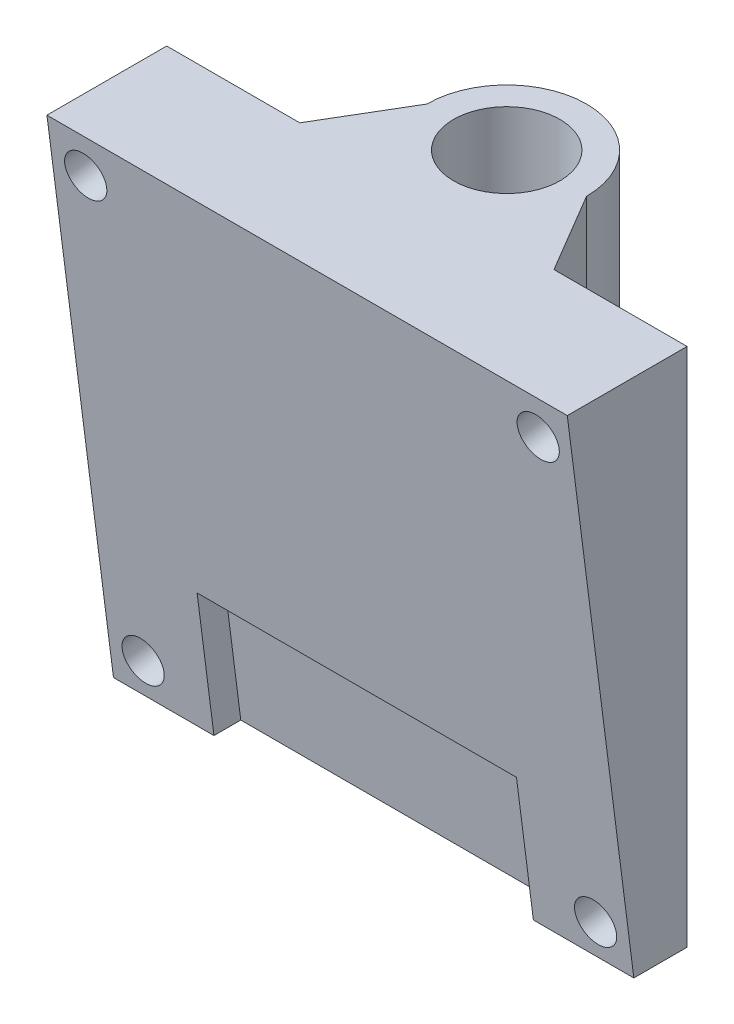
ISO-10303-21;
HEADER;
FILE_DESCRIPTION(('STEP AP214'),'2;1');
FILE_NAME('part.step','',(''),(''),'','','');
FILE_SCHEMA(('AUTOMOTIVE_DESIGN { 1 0 10303 214 1 1 1 1 }'));
ENDSEC;
DATA;
#1=APPLICATION_CONTEXT('core data for automotive mechanical design processes');
#2=APPLICATION_PROTOCOL_DEFINITION('international standard','automotive_design',2000,#1);
#3=PRODUCT_CONTEXT('',#1,'mechanical');
#4=PRODUCT('Part','Part','',(#3));
#5=PRODUCT_RELATED_PRODUCT_CATEGORY('part','',(#4));
#6=PRODUCT_DEFINITION_FORMATION('','',#4);
#7=PRODUCT_DEFINITION_CONTEXT('part definition',#1,'design');
#8=PRODUCT_DEFINITION('design','',#6,#7);
#9=PRODUCT_DEFINITION_SHAPE('','',#8);
#10=(LENGTH_UNIT() NAMED_UNIT(*) SI_UNIT(.MILLI.,.METRE.));
#11=(NAMED_UNIT(*) PLANE_ANGLE_UNIT() SI_UNIT($,.RADIAN.));
#12=(NAMED_UNIT(*) SI_UNIT($,.STERADIAN.) SOLID_ANGLE_UNIT());
#13=UNCERTAINTY_MEASURE_WITH_UNIT(LENGTH_MEASURE(1.E-05),#10,'distance_accuracy_value','');
#14=(GEOMETRIC_REPRESENTATION_CONTEXT(3) GLOBAL_UNCERTAINTY_ASSIGNED_CONTEXT((#13)) GLOBAL_UNIT_ASSIGNED_CONTEXT((#10,
#11,#12)) REPRESENTATION_CONTEXT('',''));
#15=CARTESIAN_POINT('',(0.,0.,0.));
#16=DIRECTION('',(0.,0.,1.));
#17=DIRECTION('',(1.,0.,0.));
#18=AXIS2_PLACEMENT_3D('',#15,#16,#17);
#19=CARTESIAN_POINT('',(0.,39.1,0.));
#20=DIRECTION('',(0.,1.,0.));
#21=DIRECTION('',(0.,0.,1.));
#22=AXIS2_PLACEMENT_3D('',#19,#20,#21);
#23=PLANE('',#22);
#24=DIRECTION('',(0.,0.,1.));
#25=VECTOR('',#24,1.);
#26=CARTESIAN_POINT('',(-19.55,39.1,10.));
#27=LINE('',#26,#25);
#28=CARTESIAN_POINT('',(-19.55,39.1,6.));
#29=VERTEX_POINT('',#28);
#30=CARTESIAN_POINT('',(-19.55,39.1,15.));
#31=VERTEX_POINT('',#30);
#32=EDGE_CURVE('E154',#29,#31,#27,.T.);
#33=ORIENTED_EDGE('',*,*,#32,.T.);
#34=DIRECTION('',(1.,0.,0.));
#35=VECTOR('',#34,1.);
#36=CARTESIAN_POINT('',(-19.55,39.1,15.));
#37=LINE('',#36,#35);
#38=CARTESIAN_POINT('',(19.55,39.1,15.));
#39=VERTEX_POINT('',#38);
#40=EDGE_CURVE('E230',#31,#39,#37,.T.);
#41=ORIENTED_EDGE('',*,*,#40,.T.);
#42=DIRECTION('',(0.,0.,-1.));
#43=VECTOR('',#42,1.);
#44=CARTESIAN_POINT('',(19.55,39.1,9.99999999999999));
#45=LINE('',#44,#43);
#46=CARTESIAN_POINT('',(19.55,39.1,5.99999999999999));
#47=VERTEX_POINT('',#46);
#48=EDGE_CURVE('E97',#39,#47,#45,.T.);
#49=ORIENTED_EDGE('',*,*,#48,.T.);
#50=DIRECTION('',(-1.,0.,0.));
#51=VECTOR('',#50,1.);
#52=CARTESIAN_POINT('',(19.55,39.1,5.99999999999999));
#53=LINE('',#52,#51);
#54=CARTESIAN_POINT('',(9.55,39.1,6.));
#55=VERTEX_POINT('',#54);
#56=EDGE_CURVE('E241',#47,#55,#53,.T.);
#57=ORIENTED_EDGE('',*,*,#56,.T.);
#58=DIRECTION('',(-0.509212491251785,0.,-0.860640830284707));
#59=VECTOR('',#58,1.);
#60=CARTESIAN_POINT('',(9.55,39.1,6.));
#61=LINE('',#60,#59);
#62=CARTESIAN_POINT('',(6.,39.1,0.));
#63=VERTEX_POINT('',#62);
#64=EDGE_CURVE('E115',#55,#63,#61,.T.);
#65=ORIENTED_EDGE('',*,*,#64,.T.);
#66=CARTESIAN_POINT('',(0.,39.1,0.));
#67=DIRECTION('',(0.,1.,0.));
#68=DIRECTION('',(0.,0.,1.));
#69=AXIS2_PLACEMENT_3D('',#66,#67,#68);
#70=CIRCLE('',#69,6.);
#71=CARTESIAN_POINT('',(-6.,39.1,0.));
#72=VERTEX_POINT('',#71);
#73=EDGE_CURVE('E108',#63,#72,#70,.T.);
#74=ORIENTED_EDGE('',*,*,#73,.T.);
#75=DIRECTION('',(-0.509212491251785,0.,0.860640830284707));
#76=VECTOR('',#75,1.);
#77=CARTESIAN_POINT('',(-9.55,39.1,6.));
#78=LINE('',#77,#76);
#79=CARTESIAN_POINT('',(-9.55,39.1,6.));
#80=VERTEX_POINT('',#79);
#81=EDGE_CURVE('E112',#72,#80,#78,.T.);
#82=ORIENTED_EDGE('',*,*,#81,.T.);
#83=DIRECTION('',(-1.,0.,0.));
#84=VECTOR('',#83,1.);
#85=CARTESIAN_POINT('',(-19.55,39.1,6.));
#86=LINE('',#85,#84);
#87=EDGE_CURVE('E59',#80,#29,#86,.T.);
#88=ORIENTED_EDGE('',*,*,#87,.T.);
#89=EDGE_LOOP('',(#33,#41,#49,#57,#65,#74,#82,#88));
#90=FACE_BOUND('',#89,.T.);
#91=CARTESIAN_POINT('',(0.,39.1,0.));
#92=DIRECTION('',(0.,1.,0.));
#93=DIRECTION('',(0.,0.,1.));
#94=AXIS2_PLACEMENT_3D('',#91,#92,#93);
#95=CIRCLE('',#94,4.);
#96=CARTESIAN_POINT('',(0.,39.1,4.));
#97=VERTEX_POINT('',#96);
#98=EDGE_CURVE('E140',#97,#97,#95,.T.);
#99=ORIENTED_EDGE('',*,*,#98,.F.);
#100=EDGE_LOOP('',(#99));
#101=FACE_BOUND('',#100,.T.);
#102=ADVANCED_FACE('F35',(#90,#101),#23,.T.);
#103=CARTESIAN_POINT('',(0.,0.,0.));
#104=DIRECTION('',(0.,1.,0.));
#105=DIRECTION('',(0.,0.,1.));
#106=AXIS2_PLACEMENT_3D('',#103,#104,#105);
#107=PLANE('',#106);
#108=DIRECTION('',(-1.,0.,0.));
#109=VECTOR('',#108,1.);
#110=CARTESIAN_POINT('',(0.,0.,7.98371372274613));
#111=LINE('',#110,#109);
#112=CARTESIAN_POINT('',(12.,0.,7.98371372274613));
#113=VERTEX_POINT('',#112);
#114=CARTESIAN_POINT('',(-12.,0.,7.98371372274613));
#115=VERTEX_POINT('',#114);
#116=EDGE_CURVE('E11',#113,#115,#111,.T.);
#117=ORIENTED_EDGE('',*,*,#116,.T.);
#118=DIRECTION('',(0.,0.,1.));
#119=VECTOR('',#118,1.);
#120=CARTESIAN_POINT('',(-12.,0.,0.));
#121=LINE('',#120,#119);
#122=CARTESIAN_POINT('',(-12.,0.,10.));
#123=VERTEX_POINT('',#122);
#124=EDGE_CURVE('E209',#115,#123,#121,.T.);
#125=ORIENTED_EDGE('',*,*,#124,.T.);
#126=DIRECTION('',(1.,0.,0.));
#127=VECTOR('',#126,1.);
#128=CARTESIAN_POINT('',(-19.55,0.,10.));
#129=LINE('',#128,#127);
#130=CARTESIAN_POINT('',(-19.55,0.,9.99999999999999));
#131=VERTEX_POINT('',#130);
#132=EDGE_CURVE('E141',#131,#123,#129,.T.);
#133=ORIENTED_EDGE('',*,*,#132,.F.);
#134=DIRECTION('',(0.,0.,1.));
#135=VECTOR('',#134,1.);
#136=CARTESIAN_POINT('',(-19.55,0.,10.));
#137=LINE('',#136,#135);
#138=CARTESIAN_POINT('',(-19.55,0.,6.));
#139=VERTEX_POINT('',#138);
#140=EDGE_CURVE('E136',#139,#131,#137,.T.);
#141=ORIENTED_EDGE('',*,*,#140,.F.);
#142=DIRECTION('',(-1.,0.,0.));
#143=VECTOR('',#142,1.);
#144=CARTESIAN_POINT('',(-19.55,0.,6.));
#145=LINE('',#144,#143);
#146=CARTESIAN_POINT('',(-9.55,0.,6.));
#147=VERTEX_POINT('',#146);
#148=EDGE_CURVE('E89',#147,#139,#145,.T.);
#149=ORIENTED_EDGE('',*,*,#148,.F.);
#150=DIRECTION('',(-0.509212491251785,0.,0.860640830284707));
#151=VECTOR('',#150,1.);
#152=CARTESIAN_POINT('',(-9.55,0.,6.));
#153=LINE('',#152,#151);
#154=CARTESIAN_POINT('',(-6.,0.,0.));
#155=VERTEX_POINT('',#154);
#156=EDGE_CURVE('E151',#155,#147,#153,.T.);
#157=ORIENTED_EDGE('',*,*,#156,.F.);
#158=CARTESIAN_POINT('',(0.,0.,0.));
#159=DIRECTION('',(0.,1.,0.));
#160=DIRECTION('',(0.,0.,1.));
#161=AXIS2_PLACEMENT_3D('',#158,#159,#160);
#162=CIRCLE('',#161,6.);
#163=CARTESIAN_POINT('',(6.,0.,0.));
#164=VERTEX_POINT('',#163);
#165=EDGE_CURVE('E124',#164,#155,#162,.T.);
#166=ORIENTED_EDGE('',*,*,#165,.F.);
#167=DIRECTION('',(-0.509212491251785,0.,-0.860640830284707));
#168=VECTOR('',#167,1.);
#169=CARTESIAN_POINT('',(9.55,0.,6.));
#170=LINE('',#169,#168);
#171=CARTESIAN_POINT('',(9.55,0.,6.));
#172=VERTEX_POINT('',#171);
#173=EDGE_CURVE('E148',#172,#164,#170,.T.);
#174=ORIENTED_EDGE('',*,*,#173,.F.);
#175=DIRECTION('',(-1.,0.,0.));
#176=VECTOR('',#175,1.);
#177=CARTESIAN_POINT('',(19.55,0.,5.99999999999999));
#178=LINE('',#177,#176);
#179=CARTESIAN_POINT('',(19.55,0.,5.99999999999999));
#180=VERTEX_POINT('',#179);
#181=EDGE_CURVE('E146',#180,#172,#178,.T.);
#182=ORIENTED_EDGE('',*,*,#181,.F.);
#183=DIRECTION('',(0.,0.,-1.));
#184=VECTOR('',#183,1.);
#185=CARTESIAN_POINT('',(19.55,0.,9.99999999999999));
#186=LINE('',#185,#184);
#187=CARTESIAN_POINT('',(19.55,0.,9.99999999999999));
#188=VERTEX_POINT('',#187);
#189=EDGE_CURVE('E144',#188,#180,#186,.T.);
#190=ORIENTED_EDGE('',*,*,#189,.F.);
#191=CARTESIAN_POINT('',(12.,0.,10.));
#192=VERTEX_POINT('',#191);
#193=EDGE_CURVE('E139',#192,#188,#129,.T.);
#194=ORIENTED_EDGE('',*,*,#193,.F.);
#195=DIRECTION('',(0.,0.,-1.));
#196=VECTOR('',#195,1.);
#197=CARTESIAN_POINT('',(12.,0.,0.));
#198=LINE('',#197,#196);
#199=EDGE_CURVE('E50',#192,#113,#198,.T.);
#200=ORIENTED_EDGE('',*,*,#199,.T.);
#201=EDGE_LOOP('',(#117,#125,#133,#141,#149,#157,#166,#174,#182,#190,#194,#200));
#202=FACE_BOUND('',#201,.T.);
#203=CARTESIAN_POINT('',(0.,0.,0.));
#204=DIRECTION('',(0.,1.,0.));
#205=DIRECTION('',(0.,0.,1.));
#206=AXIS2_PLACEMENT_3D('',#203,#204,#205);
#207=CIRCLE('',#206,4.);
#208=CARTESIAN_POINT('',(0.,0.,4.));
#209=VERTEX_POINT('',#208);
#210=EDGE_CURVE('E234',#209,#209,#207,.T.);
#211=ORIENTED_EDGE('',*,*,#210,.T.);
#212=EDGE_LOOP('',(#211));
#213=FACE_BOUND('',#212,.T.);
#214=ADVANCED_FACE('F251',(#202,#213),#107,.F.);
#215=CARTESIAN_POINT('',(-19.55,39.1,10.));
#216=DIRECTION('',(1.,0.,0.));
#217=DIRECTION('',(0.,0.,-1.));
#218=AXIS2_PLACEMENT_3D('',#215,#216,#217);
#219=PLANE('',#218);
#220=ORIENTED_EDGE('',*,*,#140,.T.);
#221=DIRECTION('',(0.,-0.991922636464077,-0.126844326913565));
#222=VECTOR('',#221,1.);
#223=CARTESIAN_POINT('',(-19.55,0.,9.99999999999999));
#224=LINE('',#223,#222);
#225=EDGE_CURVE('E227',#31,#131,#224,.T.);
#226=ORIENTED_EDGE('',*,*,#225,.F.);
#227=ORIENTED_EDGE('',*,*,#32,.F.);
#228=DIRECTION('',(0.,-1.,0.));
#229=VECTOR('',#228,1.);
#230=CARTESIAN_POINT('',(-19.55,39.1,6.));
#231=LINE('',#230,#229);
#232=EDGE_CURVE('E132',#29,#139,#231,.T.);
#233=ORIENTED_EDGE('',*,*,#232,.T.);
#234=EDGE_LOOP('',(#220,#226,#227,#233));
#235=FACE_BOUND('',#234,.T.);
#236=ADVANCED_FACE('F37',(#235),#219,.F.);
#237=CARTESIAN_POINT('',(19.55,39.1,9.99999999999999));
#238=DIRECTION('',(-1.,0.,0.));
#239=DIRECTION('',(0.,0.,1.));
#240=AXIS2_PLACEMENT_3D('',#237,#238,#239);
#241=PLANE('',#240);
#242=ORIENTED_EDGE('',*,*,#189,.T.);
#243=DIRECTION('',(0.,-1.,0.));
#244=VECTOR('',#243,1.);
#245=CARTESIAN_POINT('',(19.55,39.1,5.99999999999999));
#246=LINE('',#245,#244);
#247=EDGE_CURVE('E161',#47,#180,#246,.T.);
#248=ORIENTED_EDGE('',*,*,#247,.F.);
#249=ORIENTED_EDGE('',*,*,#48,.F.);
#250=DIRECTION('',(0.,-0.991922636464077,-0.126844326913565));
#251=VECTOR('',#250,1.);
#252=CARTESIAN_POINT('',(19.55,0.,9.99999999999999));
#253=LINE('',#252,#251);
#254=EDGE_CURVE('E226',#39,#188,#253,.T.);
#255=ORIENTED_EDGE('',*,*,#254,.T.);
#256=EDGE_LOOP('',(#242,#248,#249,#255));
#257=FACE_BOUND('',#256,.T.);
#258=ADVANCED_FACE('F265',(#257),#241,.F.);
#259=CARTESIAN_POINT('',(19.55,39.1,5.99999999999999));
#260=DIRECTION('',(0.,0.,1.));
#261=DIRECTION('',(1.,0.,0.));
#262=AXIS2_PLACEMENT_3D('',#259,#260,#261);
#263=PLANE('',#262);
#264=CARTESIAN_POINT('',(17.,37.3591406682212,5.99999999999999));
#265=DIRECTION('',(0.,0.,1.));
#266=DIRECTION('',(0.,-1.,0.));
#267=AXIS2_PLACEMENT_3D('',#264,#265,#266);
#268=ELLIPSE('',#267,1.58782544333742,1.57499999999999);
#269=CARTESIAN_POINT('',(17.,35.7713152248838,5.99999999999999));
#270=VERTEX_POINT('',#269);
#271=EDGE_CURVE('E169',#270,#270,#268,.T.);
#272=ORIENTED_EDGE('',*,*,#271,.T.);
#273=EDGE_LOOP('',(#272));
#274=FACE_BOUND('',#273,.T.);
#275=CARTESIAN_POINT('',(17.,3.08227395490534,5.99999999999999));
#276=DIRECTION('',(0.,0.,1.));
#277=DIRECTION('',(0.,-1.,0.));
#278=AXIS2_PLACEMENT_3D('',#275,#276,#277);
#279=ELLIPSE('',#278,1.58782544333742,1.57499999999999);
#280=CARTESIAN_POINT('',(17.,1.49444851156792,5.99999999999999));
#281=VERTEX_POINT('',#280);
#282=EDGE_CURVE('E216',#281,#281,#279,.T.);
#283=ORIENTED_EDGE('',*,*,#282,.T.);
#284=EDGE_LOOP('',(#283));
#285=FACE_BOUND('',#284,.T.);
#286=ORIENTED_EDGE('',*,*,#181,.T.);
#287=DIRECTION('',(0.,-1.,0.));
#288=VECTOR('',#287,1.);
#289=CARTESIAN_POINT('',(9.55,39.1,6.));
#290=LINE('',#289,#288);
#291=EDGE_CURVE('E158',#55,#172,#290,.T.);
#292=ORIENTED_EDGE('',*,*,#291,.F.);
#293=ORIENTED_EDGE('',*,*,#56,.F.);
#294=ORIENTED_EDGE('',*,*,#247,.T.);
#295=EDGE_LOOP('',(#286,#292,#293,#294));
#296=FACE_BOUND('',#295,.T.);
#297=ADVANCED_FACE('F245',(#274,#285,#296),#263,.F.);
#298=CARTESIAN_POINT('',(9.55,39.1,6.));
#299=DIRECTION('',(-0.860640830284707,0.,0.509212491251785));
#300=DIRECTION('',(0.509212491251785,0.,0.860640830284707));
#301=AXIS2_PLACEMENT_3D('',#298,#299,#300);
#302=PLANE('',#301);
#303=ORIENTED_EDGE('',*,*,#173,.T.);
#304=DIRECTION('',(0.,-1.,0.));
#305=VECTOR('',#304,1.);
#306=CARTESIAN_POINT('',(6.,39.1,0.));
#307=LINE('',#306,#305);
#308=EDGE_CURVE('E127',#63,#164,#307,.T.);
#309=ORIENTED_EDGE('',*,*,#308,.F.);
#310=ORIENTED_EDGE('',*,*,#64,.F.);
#311=ORIENTED_EDGE('',*,*,#291,.T.);
#312=EDGE_LOOP('',(#303,#309,#310,#311));
#313=FACE_BOUND('',#312,.T.);
#314=ADVANCED_FACE('F249',(#313),#302,.F.);
#315=CARTESIAN_POINT('',(0.,39.1,0.));
#316=DIRECTION('',(0.,-1.,0.));
#317=DIRECTION('',(0.,0.,-1.));
#318=AXIS2_PLACEMENT_3D('',#315,#316,#317);
#319=CYLINDRICAL_SURFACE('',#318,6.);
#320=ORIENTED_EDGE('',*,*,#165,.T.);
#321=DIRECTION('',(0.,-1.,0.));
#322=VECTOR('',#321,1.);
#323=CARTESIAN_POINT('',(-6.,39.1,0.));
#324=LINE('',#323,#322);
#325=EDGE_CURVE('E121',#72,#155,#324,.T.);
#326=ORIENTED_EDGE('',*,*,#325,.F.);
#327=ORIENTED_EDGE('',*,*,#73,.F.);
#328=ORIENTED_EDGE('',*,*,#308,.T.);
#329=EDGE_LOOP('',(#320,#326,#327,#328));
#330=FACE_BOUND('',#329,.T.);
#331=ADVANCED_FACE('F122',(#330),#319,.T.);
#332=CARTESIAN_POINT('',(-9.55,39.1,6.));
#333=DIRECTION('',(0.860640830284708,0.,0.509212491251785));
#334=DIRECTION('',(0.509212491251785,0.,-0.860640830284708));
#335=AXIS2_PLACEMENT_3D('',#332,#333,#334);
#336=PLANE('',#335);
#337=ORIENTED_EDGE('',*,*,#156,.T.);
#338=DIRECTION('',(0.,-1.,0.));
#339=VECTOR('',#338,1.);
#340=CARTESIAN_POINT('',(-9.55,39.1,6.));
#341=LINE('',#340,#339);
#342=EDGE_CURVE('E128',#80,#147,#341,.T.);
#343=ORIENTED_EDGE('',*,*,#342,.F.);
#344=ORIENTED_EDGE('',*,*,#81,.F.);
#345=ORIENTED_EDGE('',*,*,#325,.T.);
#346=EDGE_LOOP('',(#337,#343,#344,#345));
#347=FACE_BOUND('',#346,.T.);
#348=ADVANCED_FACE('F130',(#347),#336,.F.);
#349=CARTESIAN_POINT('',(-19.55,39.1,6.));
#350=DIRECTION('',(0.,0.,1.));
#351=DIRECTION('',(1.,0.,0.));
#352=AXIS2_PLACEMENT_3D('',#349,#350,#351);
#353=PLANE('',#352);
#354=CARTESIAN_POINT('',(-17.,37.3591406682212,6.));
#355=DIRECTION('',(0.,0.,1.));
#356=DIRECTION('',(0.,-1.,0.));
#357=AXIS2_PLACEMENT_3D('',#354,#355,#356);
#358=ELLIPSE('',#357,1.58782544333742,1.57499999999999);
#359=CARTESIAN_POINT('',(-17.,35.7713152248838,6.));
#360=VERTEX_POINT('',#359);
#361=EDGE_CURVE('E164',#360,#360,#358,.T.);
#362=ORIENTED_EDGE('',*,*,#361,.T.);
#363=EDGE_LOOP('',(#362));
#364=FACE_BOUND('',#363,.T.);
#365=CARTESIAN_POINT('',(-17.,3.08227395490534,6.));
#366=DIRECTION('',(0.,0.,1.));
#367=DIRECTION('',(0.,-1.,0.));
#368=AXIS2_PLACEMENT_3D('',#365,#366,#367);
#369=ELLIPSE('',#368,1.58782544333742,1.57499999999999);
#370=CARTESIAN_POINT('',(-17.,1.49444851156792,6.));
#371=VERTEX_POINT('',#370);
#372=EDGE_CURVE('E223',#371,#371,#369,.T.);
#373=ORIENTED_EDGE('',*,*,#372,.T.);
#374=EDGE_LOOP('',(#373));
#375=FACE_BOUND('',#374,.T.);
#376=ORIENTED_EDGE('',*,*,#148,.T.);
#377=ORIENTED_EDGE('',*,*,#232,.F.);
#378=ORIENTED_EDGE('',*,*,#87,.F.);
#379=ORIENTED_EDGE('',*,*,#342,.T.);
#380=EDGE_LOOP('',(#376,#377,#378,#379));
#381=FACE_BOUND('',#380,.T.);
#382=ADVANCED_FACE('F254',(#364,#375,#381),#353,.F.);
#383=CARTESIAN_POINT('',(0.,39.1,0.));
#384=DIRECTION('',(0.,-1.,0.));
#385=DIRECTION('',(0.,0.,-1.));
#386=AXIS2_PLACEMENT_3D('',#383,#384,#385);
#387=CYLINDRICAL_SURFACE('',#386,4.);
#388=ORIENTED_EDGE('',*,*,#98,.T.);
#389=EDGE_LOOP('',(#388));
#390=FACE_BOUND('',#389,.T.);
#391=ORIENTED_EDGE('',*,*,#210,.F.);
#392=EDGE_LOOP('',(#391));
#393=FACE_BOUND('',#392,.T.);
#394=ADVANCED_FACE('F304',(#390,#393),#387,.F.);
#395=CARTESIAN_POINT('',(-19.55,0.,9.99999999999999));
#396=DIRECTION('',(0.,-0.126844326913565,0.991922636464077));
#397=DIRECTION('',(0.,-0.991922636464077,-0.126844326913565));
#398=AXIS2_PLACEMENT_3D('',#395,#396,#397);
#399=PLANE('',#398);
#400=DIRECTION('',(0.,-0.991922636464077,-0.126844326913565));
#401=VECTOR('',#400,1.);
#402=CARTESIAN_POINT('',(-12.,-1.98384527292816,9.74631134617287));
#403=LINE('',#402,#401);
#404=CARTESIAN_POINT('',(-12.,9.91922636464077,11.2684432691356));
#405=VERTEX_POINT('',#404);
#406=EDGE_CURVE('E199',#405,#123,#403,.T.);
#407=ORIENTED_EDGE('',*,*,#406,.F.);
#408=DIRECTION('',(-1.,0.,0.));
#409=VECTOR('',#408,1.);
#410=CARTESIAN_POINT('',(-12.,9.91922636464077,11.2684432691356));
#411=LINE('',#410,#409);
#412=CARTESIAN_POINT('',(12.,9.91922636464077,11.2684432691356));
#413=VERTEX_POINT('',#412);
#414=EDGE_CURVE('E189',#413,#405,#411,.T.);
#415=ORIENTED_EDGE('',*,*,#414,.F.);
#416=DIRECTION('',(0.,0.991922636464077,0.126844326913565));
#417=VECTOR('',#416,1.);
#418=CARTESIAN_POINT('',(12.,0.,9.99999999999999));
#419=LINE('',#418,#417);
#420=EDGE_CURVE('E43',#192,#413,#419,.T.);
#421=ORIENTED_EDGE('',*,*,#420,.F.);
#422=ORIENTED_EDGE('',*,*,#193,.T.);
#423=ORIENTED_EDGE('',*,*,#254,.F.);
#424=ORIENTED_EDGE('',*,*,#40,.F.);
#425=ORIENTED_EDGE('',*,*,#225,.T.);
#426=ORIENTED_EDGE('',*,*,#132,.T.);
#427=EDGE_LOOP('',(#407,#415,#421,#422,#423,#424,#425,#426));
#428=FACE_BOUND('',#427,.T.);
#429=CARTESIAN_POINT('',(17.,36.254772362762,14.6361601486908));
#430=DIRECTION('',(0.,-0.126844326913565,0.991922636464077));
#431=DIRECTION('',(0.,-0.991922636464077,-0.126844326913565));
#432=AXIS2_PLACEMENT_3D('',#429,#430,#431);
#433=CIRCLE('',#432,1.57499999999999);
#434=CARTESIAN_POINT('',(17.,34.6924942103311,14.4363803338019));
#435=VERTEX_POINT('',#434);
#436=EDGE_CURVE('E172',#435,#435,#433,.T.);
#437=ORIENTED_EDGE('',*,*,#436,.F.);
#438=EDGE_LOOP('',(#437));
#439=FACE_BOUND('',#438,.T.);
#440=CARTESIAN_POINT('',(17.,2.5294027229834,10.3234530336296));
#441=DIRECTION('',(0.,-0.126844326913565,0.991922636464077));
#442=DIRECTION('',(0.,-0.991922636464077,-0.126844326913565));
#443=AXIS2_PLACEMENT_3D('',#440,#441,#442);
#444=CIRCLE('',#443,1.57499999999999);
#445=CARTESIAN_POINT('',(17.,0.967124570552488,10.1236732187407));
#446=VERTEX_POINT('',#445);
#447=EDGE_CURVE('E171',#446,#446,#444,.T.);
#448=ORIENTED_EDGE('',*,*,#447,.F.);
#449=EDGE_LOOP('',(#448));
#450=FACE_BOUND('',#449,.T.);
#451=CARTESIAN_POINT('',(-17.,36.254772362762,14.6361601486908));
#452=DIRECTION('',(0.,-0.126844326913565,0.991922636464077));
#453=DIRECTION('',(0.,-0.991922636464077,-0.126844326913565));
#454=AXIS2_PLACEMENT_3D('',#451,#452,#453);
#455=CIRCLE('',#454,1.57499999999999);
#456=CARTESIAN_POINT('',(-17.,34.6924942103311,14.4363803338019));
#457=VERTEX_POINT('',#456);
#458=EDGE_CURVE('E168',#457,#457,#455,.T.);
#459=ORIENTED_EDGE('',*,*,#458,.F.);
#460=EDGE_LOOP('',(#459));
#461=FACE_BOUND('',#460,.T.);
#462=CARTESIAN_POINT('',(-17.,2.5294027229834,10.3234530336296));
#463=DIRECTION('',(0.,-0.126844326913565,0.991922636464077));
#464=DIRECTION('',(0.,-0.991922636464077,-0.126844326913565));
#465=AXIS2_PLACEMENT_3D('',#462,#463,#464);
#466=CIRCLE('',#465,1.57499999999999);
#467=CARTESIAN_POINT('',(-17.,0.967124570552486,10.1236732187407));
#468=VERTEX_POINT('',#467);
#469=EDGE_CURVE('E167',#468,#468,#466,.T.);
#470=ORIENTED_EDGE('',*,*,#469,.F.);
#471=EDGE_LOOP('',(#470));
#472=FACE_BOUND('',#471,.T.);
#473=ADVANCED_FACE('F196',(#428,#439,#450,#461,#472),#399,.T.);
#474=CARTESIAN_POINT('',(-17.,2.5294027229834,10.3234530336296));
#475=DIRECTION('',(0.,-0.126844326913565,0.991922636464077));
#476=DIRECTION('',(0.,-0.991922636464077,-0.126844326913565));
#477=AXIS2_PLACEMENT_3D('',#474,#475,#476);
#478=CYLINDRICAL_SURFACE('',#477,1.57499999999999);
#479=ORIENTED_EDGE('',*,*,#469,.T.);
#480=EDGE_LOOP('',(#479));
#481=FACE_BOUND('',#480,.T.);
#482=ORIENTED_EDGE('',*,*,#372,.F.);
#483=EDGE_LOOP('',(#482));
#484=FACE_BOUND('',#483,.T.);
#485=ADVANCED_FACE('F342',(#481,#484),#478,.F.);
#486=CARTESIAN_POINT('',(-17.,36.254772362762,14.6361601486908));
#487=DIRECTION('',(0.,-0.126844326913565,0.991922636464077));
#488=DIRECTION('',(0.,-0.991922636464077,-0.126844326913565));
#489=AXIS2_PLACEMENT_3D('',#486,#487,#488);
#490=CYLINDRICAL_SURFACE('',#489,1.57499999999999);
#491=ORIENTED_EDGE('',*,*,#458,.T.);
#492=EDGE_LOOP('',(#491));
#493=FACE_BOUND('',#492,.T.);
#494=ORIENTED_EDGE('',*,*,#361,.F.);
#495=EDGE_LOOP('',(#494));
#496=FACE_BOUND('',#495,.T.);
#497=ADVANCED_FACE('F379',(#493,#496),#490,.F.);
#498=CARTESIAN_POINT('',(17.,2.5294027229834,10.3234530336296));
#499=DIRECTION('',(0.,-0.126844326913565,0.991922636464077));
#500=DIRECTION('',(0.,-0.991922636464077,-0.126844326913565));
#501=AXIS2_PLACEMENT_3D('',#498,#499,#500);
#502=CYLINDRICAL_SURFACE('',#501,1.57499999999999);
#503=ORIENTED_EDGE('',*,*,#447,.T.);
#504=EDGE_LOOP('',(#503));
#505=FACE_BOUND('',#504,.T.);
#506=ORIENTED_EDGE('',*,*,#282,.F.);
#507=EDGE_LOOP('',(#506));
#508=FACE_BOUND('',#507,.T.);
#509=ADVANCED_FACE('F294',(#505,#508),#502,.F.);
#510=CARTESIAN_POINT('',(17.,36.254772362762,14.6361601486908));
#511=DIRECTION('',(0.,-0.126844326913565,0.991922636464077));
#512=DIRECTION('',(0.,-0.991922636464077,-0.126844326913565));
#513=AXIS2_PLACEMENT_3D('',#510,#511,#512);
#514=CYLINDRICAL_SURFACE('',#513,1.57499999999999);
#515=ORIENTED_EDGE('',*,*,#436,.T.);
#516=EDGE_LOOP('',(#515));
#517=FACE_BOUND('',#516,.T.);
#518=ORIENTED_EDGE('',*,*,#271,.F.);
#519=EDGE_LOOP('',(#518));
#520=FACE_BOUND('',#519,.T.);
#521=ADVANCED_FACE('F287',(#517,#520),#514,.F.);
#522=CARTESIAN_POINT('',(0.,-1.00450893789901,7.85525989437029));
#523=DIRECTION('',(0.,0.126844326913565,-0.991922636464077));
#524=DIRECTION('',(0.,0.991922636464077,0.126844326913565));
#525=AXIS2_PLACEMENT_3D('',#522,#523,#524);
#526=PLANE('',#525);
#527=DIRECTION('',(0.,0.991922636464077,0.126844326913565));
#528=VECTOR('',#527,1.);
#529=CARTESIAN_POINT('',(12.,10.1729150184679,9.28459799620749));
#530=LINE('',#529,#528);
#531=CARTESIAN_POINT('',(12.,10.1729150184679,9.28459799620749));
#532=VERTEX_POINT('',#531);
#533=EDGE_CURVE('E201',#113,#532,#530,.T.);
#534=ORIENTED_EDGE('',*,*,#533,.T.);
#535=DIRECTION('',(-1.,0.,0.));
#536=VECTOR('',#535,1.);
#537=CARTESIAN_POINT('',(-12.,10.1729150184679,9.28459799620749));
#538=LINE('',#537,#536);
#539=CARTESIAN_POINT('',(-12.,10.1729150184679,9.28459799620749));
#540=VERTEX_POINT('',#539);
#541=EDGE_CURVE('E192',#532,#540,#538,.T.);
#542=ORIENTED_EDGE('',*,*,#541,.T.);
#543=DIRECTION('',(0.,-0.991922636464077,-0.126844326913565));
#544=VECTOR('',#543,1.);
#545=CARTESIAN_POINT('',(-12.,-1.73015661910103,7.76246607324472));
#546=LINE('',#545,#544);
#547=EDGE_CURVE('E194',#540,#115,#546,.T.);
#548=ORIENTED_EDGE('',*,*,#547,.T.);
#549=ORIENTED_EDGE('',*,*,#116,.F.);
#550=EDGE_LOOP('',(#534,#542,#548,#549));
#551=FACE_BOUND('',#550,.T.);
#552=ADVANCED_FACE('F283',(#551),#526,.F.);
#553=CARTESIAN_POINT('',(-12.,-1.73015661910103,7.76246607324472));
#554=DIRECTION('',(-1.,0.,0.));
#555=DIRECTION('',(0.,0.,1.));
#556=AXIS2_PLACEMENT_3D('',#553,#554,#555);
#557=PLANE('',#556);
#558=ORIENTED_EDGE('',*,*,#547,.F.);
#559=DIRECTION('',(0.,-0.126844326913565,0.991922636464077));
#560=VECTOR('',#559,1.);
#561=CARTESIAN_POINT('',(-12.,10.1729150184679,9.28459799620749));
#562=LINE('',#561,#560);
#563=EDGE_CURVE('E193',#540,#405,#562,.T.);
#564=ORIENTED_EDGE('',*,*,#563,.T.);
#565=ORIENTED_EDGE('',*,*,#406,.T.);
#566=ORIENTED_EDGE('',*,*,#124,.F.);
#567=EDGE_LOOP('',(#558,#564,#565,#566));
#568=FACE_BOUND('',#567,.T.);
#569=ADVANCED_FACE('F282',(#568),#557,.F.);
#570=CARTESIAN_POINT('',(12.,10.1729150184679,9.28459799620749));
#571=DIRECTION('',(1.,0.,0.));
#572=DIRECTION('',(0.,1.,0.));
#573=AXIS2_PLACEMENT_3D('',#570,#571,#572);
#574=PLANE('',#573);
#575=ORIENTED_EDGE('',*,*,#420,.T.);
#576=DIRECTION('',(0.,-0.126844326913565,0.991922636464077));
#577=VECTOR('',#576,1.);
#578=CARTESIAN_POINT('',(12.,10.1729150184679,9.28459799620749));
#579=LINE('',#578,#577);
#580=EDGE_CURVE('E178',#532,#413,#579,.T.);
#581=ORIENTED_EDGE('',*,*,#580,.F.);
#582=ORIENTED_EDGE('',*,*,#533,.F.);
#583=ORIENTED_EDGE('',*,*,#199,.F.);
#584=EDGE_LOOP('',(#575,#581,#582,#583));
#585=FACE_BOUND('',#584,.T.);
#586=ADVANCED_FACE('F176',(#585),#574,.F.);
#587=CARTESIAN_POINT('',(-12.,10.1729150184679,9.28459799620749));
#588=DIRECTION('',(0.,0.991922636464077,0.126844326913565));
#589=DIRECTION('',(0.,-0.126844326913565,0.991922636464077));
#590=AXIS2_PLACEMENT_3D('',#587,#588,#589);
#591=PLANE('',#590);
#592=ORIENTED_EDGE('',*,*,#414,.T.);
#593=ORIENTED_EDGE('',*,*,#563,.F.);
#594=ORIENTED_EDGE('',*,*,#541,.F.);
#595=ORIENTED_EDGE('',*,*,#580,.T.);
#596=EDGE_LOOP('',(#592,#593,#594,#595));
#597=FACE_BOUND('',#596,.T.);
#598=ADVANCED_FACE('F187',(#597),#591,.F.);
#599=CLOSED_SHELL('',(#102,#214,#236,#258,#297,#314,#331,#348,#382,#394,#473,#485,#497,#509,
#521,#552,#569,#586,#598));
#600=MANIFOLD_SOLID_BREP('B2',#599);
#601=ADVANCED_BREP_SHAPE_REPRESENTATION('',(#18,#600),#14);
#602=SHAPE_DEFINITION_REPRESENTATION(#9,#601);
ENDSEC;
END-ISO-10303-21;
